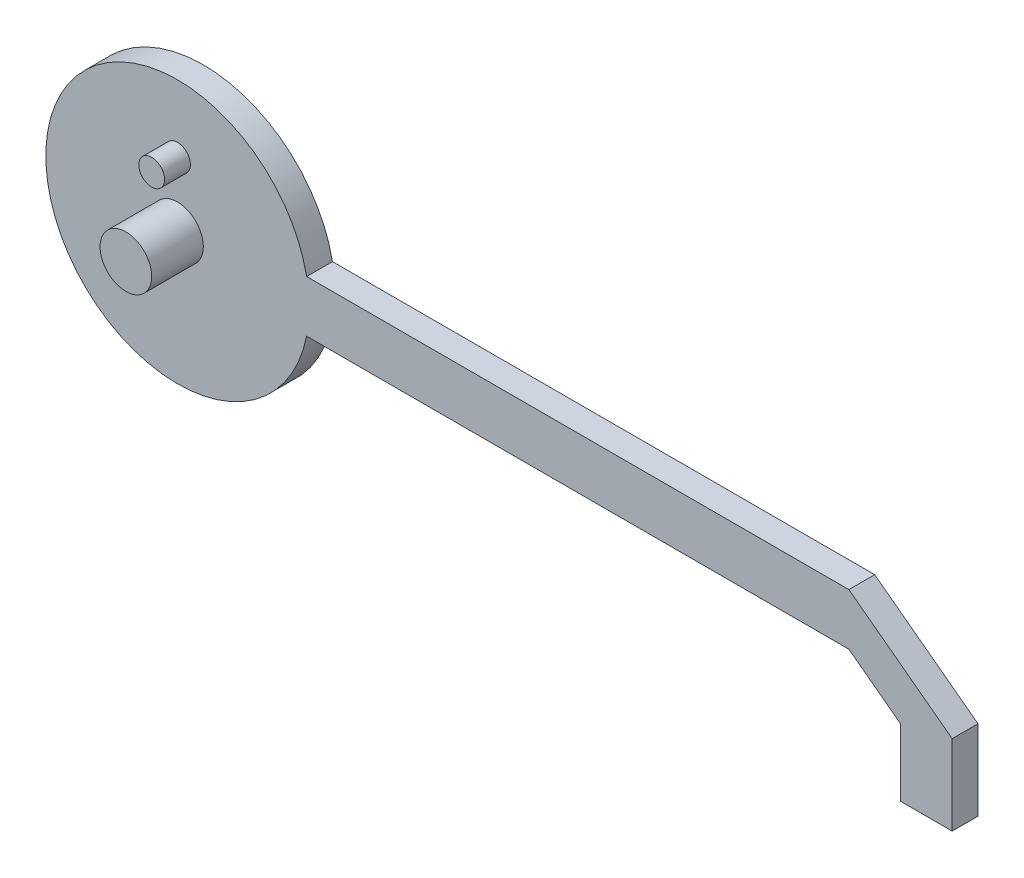
ISO-10303-21;
HEADER;
FILE_DESCRIPTION(('STEP AP214'),'2;1');
FILE_NAME('part.step','',(''),(''),'','','');
FILE_SCHEMA(('AUTOMOTIVE_DESIGN { 1 0 10303 214 1 1 1 1 }'));
ENDSEC;
DATA;
#1=APPLICATION_CONTEXT('core data for automotive mechanical design processes');
#2=APPLICATION_PROTOCOL_DEFINITION('international standard','automotive_design',2000,#1);
#3=PRODUCT_CONTEXT('',#1,'mechanical');
#4=PRODUCT('Part','Part','',(#3));
#5=PRODUCT_RELATED_PRODUCT_CATEGORY('part','',(#4));
#6=PRODUCT_DEFINITION_FORMATION('','',#4);
#7=PRODUCT_DEFINITION_CONTEXT('part definition',#1,'design');
#8=PRODUCT_DEFINITION('design','',#6,#7);
#9=PRODUCT_DEFINITION_SHAPE('','',#8);
#10=(LENGTH_UNIT() NAMED_UNIT(*) SI_UNIT(.MILLI.,.METRE.));
#11=(NAMED_UNIT(*) PLANE_ANGLE_UNIT() SI_UNIT($,.RADIAN.));
#12=(NAMED_UNIT(*) SI_UNIT($,.STERADIAN.) SOLID_ANGLE_UNIT());
#13=UNCERTAINTY_MEASURE_WITH_UNIT(LENGTH_MEASURE(1.E-05),#10,'distance_accuracy_value','');
#14=(GEOMETRIC_REPRESENTATION_CONTEXT(3) GLOBAL_UNCERTAINTY_ASSIGNED_CONTEXT((#13)) GLOBAL_UNIT_ASSIGNED_CONTEXT((#10,
#11,#12)) REPRESENTATION_CONTEXT('',''));
#15=CARTESIAN_POINT('',(0.,0.,0.));
#16=DIRECTION('',(0.,0.,1.));
#17=DIRECTION('',(1.,0.,0.));
#18=AXIS2_PLACEMENT_3D('',#15,#16,#17);
#19=CARTESIAN_POINT('',(-77.5024997500499,0.,5.));
#20=DIRECTION('',(0.,0.,-1.));
#21=DIRECTION('',(-1.,0.,0.));
#22=AXIS2_PLACEMENT_3D('',#19,#20,#21);
#23=CYLINDRICAL_SURFACE('',#22,25.5);
#24=CARTESIAN_POINT('',(-77.5024997500499,0.,0.));
#25=DIRECTION('',(0.,0.,1.));
#26=DIRECTION('',(1.,0.,0.));
#27=AXIS2_PLACEMENT_3D('',#24,#25,#26);
#28=CIRCLE('',#27,25.5);
#29=CARTESIAN_POINT('',(-52.4975002499499,5.,0.));
#30=VERTEX_POINT('',#29);
#31=CARTESIAN_POINT('',(-52.4975002499499,-5.,0.));
#32=VERTEX_POINT('',#31);
#33=EDGE_CURVE('E140',#30,#32,#28,.T.);
#34=ORIENTED_EDGE('',*,*,#33,.T.);
#35=DIRECTION('',(0.,0.,-1.));
#36=VECTOR('',#35,1.);
#37=CARTESIAN_POINT('',(-52.4975002499499,-5.,5.));
#38=LINE('',#37,#36);
#39=CARTESIAN_POINT('',(-52.4975002499499,-5.,5.));
#40=VERTEX_POINT('',#39);
#41=EDGE_CURVE('E11',#40,#32,#38,.T.);
#42=ORIENTED_EDGE('',*,*,#41,.F.);
#43=CARTESIAN_POINT('',(-77.5024997500499,0.,5.));
#44=DIRECTION('',(0.,0.,1.));
#45=DIRECTION('',(1.,0.,0.));
#46=AXIS2_PLACEMENT_3D('',#43,#44,#45);
#47=CIRCLE('',#46,25.5);
#48=CARTESIAN_POINT('',(-52.4975002499499,5.,5.));
#49=VERTEX_POINT('',#48);
#50=EDGE_CURVE('E163',#49,#40,#47,.T.);
#51=ORIENTED_EDGE('',*,*,#50,.F.);
#52=DIRECTION('',(0.,0.,-1.));
#53=VECTOR('',#52,1.);
#54=CARTESIAN_POINT('',(-52.4975002499499,5.,5.));
#55=LINE('',#54,#53);
#56=EDGE_CURVE('E136',#49,#30,#55,.T.);
#57=ORIENTED_EDGE('',*,*,#56,.T.);
#58=EDGE_LOOP('',(#34,#42,#51,#57));
#59=FACE_BOUND('',#58,.T.);
#60=ADVANCED_FACE('F39',(#59),#23,.T.);
#61=CARTESIAN_POINT('',(52.4975002499501,-5.,5.));
#62=DIRECTION('',(0.,1.,0.));
#63=DIRECTION('',(0.,0.,1.));
#64=AXIS2_PLACEMENT_3D('',#61,#62,#63);
#65=PLANE('',#64);
#66=DIRECTION('',(1.,0.,0.));
#67=VECTOR('',#66,1.);
#68=CARTESIAN_POINT('',(52.4975002499501,-5.,0.));
#69=LINE('',#68,#67);
#70=CARTESIAN_POINT('',(52.4975002499501,-5.,0.));
#71=VERTEX_POINT('',#70);
#72=EDGE_CURVE('E144',#32,#71,#69,.T.);
#73=ORIENTED_EDGE('',*,*,#72,.T.);
#74=DIRECTION('',(0.,0.,-1.));
#75=VECTOR('',#74,1.);
#76=CARTESIAN_POINT('',(52.4975002499501,-5.,5.));
#77=LINE('',#76,#75);
#78=CARTESIAN_POINT('',(52.4975002499501,-5.,5.));
#79=VERTEX_POINT('',#78);
#80=EDGE_CURVE('E48',#79,#71,#77,.T.);
#81=ORIENTED_EDGE('',*,*,#80,.F.);
#82=DIRECTION('',(1.,0.,0.));
#83=VECTOR('',#82,1.);
#84=CARTESIAN_POINT('',(52.4975002499501,-5.,5.));
#85=LINE('',#84,#83);
#86=EDGE_CURVE('E99',#40,#79,#85,.T.);
#87=ORIENTED_EDGE('',*,*,#86,.F.);
#88=ORIENTED_EDGE('',*,*,#41,.T.);
#89=EDGE_LOOP('',(#73,#81,#87,#88));
#90=FACE_BOUND('',#89,.T.);
#91=ADVANCED_FACE('F251',(#90),#65,.F.);
#92=CARTESIAN_POINT('',(52.4975002499501,-5.,5.));
#93=DIRECTION('',(0.6,0.8,0.));
#94=DIRECTION('',(-0.8,0.6,0.));
#95=AXIS2_PLACEMENT_3D('',#92,#93,#94);
#96=PLANE('',#95);
#97=DIRECTION('',(0.8,-0.6,0.));
#98=VECTOR('',#97,1.);
#99=CARTESIAN_POINT('',(52.4975002499501,-5.,0.));
#100=LINE('',#99,#98);
#101=CARTESIAN_POINT('',(62.4975002499501,-12.5,0.));
#102=VERTEX_POINT('',#101);
#103=EDGE_CURVE('E148',#71,#102,#100,.T.);
#104=ORIENTED_EDGE('',*,*,#103,.T.);
#105=DIRECTION('',(0.,0.,-1.));
#106=VECTOR('',#105,1.);
#107=CARTESIAN_POINT('',(62.4975002499501,-12.5,5.));
#108=LINE('',#107,#106);
#109=CARTESIAN_POINT('',(62.4975002499501,-12.5,5.));
#110=VERTEX_POINT('',#109);
#111=EDGE_CURVE('E174',#110,#102,#108,.T.);
#112=ORIENTED_EDGE('',*,*,#111,.F.);
#113=DIRECTION('',(0.8,-0.6,0.));
#114=VECTOR('',#113,1.);
#115=CARTESIAN_POINT('',(52.4975002499501,-5.,5.));
#116=LINE('',#115,#114);
#117=EDGE_CURVE('E184',#79,#110,#116,.T.);
#118=ORIENTED_EDGE('',*,*,#117,.F.);
#119=ORIENTED_EDGE('',*,*,#80,.T.);
#120=EDGE_LOOP('',(#104,#112,#118,#119));
#121=FACE_BOUND('',#120,.T.);
#122=ADVANCED_FACE('F182',(#121),#96,.F.);
#123=CARTESIAN_POINT('',(62.4975002499501,-25.5,5.));
#124=DIRECTION('',(1.,0.,0.));
#125=DIRECTION('',(0.,0.,-1.));
#126=AXIS2_PLACEMENT_3D('',#123,#124,#125);
#127=PLANE('',#126);
#128=DIRECTION('',(0.,-1.,0.));
#129=VECTOR('',#128,1.);
#130=CARTESIAN_POINT('',(62.4975002499501,-25.5,0.));
#131=LINE('',#130,#129);
#132=CARTESIAN_POINT('',(62.4975002499501,-25.5,0.));
#133=VERTEX_POINT('',#132);
#134=EDGE_CURVE('E151',#102,#133,#131,.T.);
#135=ORIENTED_EDGE('',*,*,#134,.T.);
#136=DIRECTION('',(0.,0.,-1.));
#137=VECTOR('',#136,1.);
#138=CARTESIAN_POINT('',(62.4975002499501,-25.5,5.));
#139=LINE('',#138,#137);
#140=CARTESIAN_POINT('',(62.4975002499501,-25.5,5.));
#141=VERTEX_POINT('',#140);
#142=EDGE_CURVE('E170',#141,#133,#139,.T.);
#143=ORIENTED_EDGE('',*,*,#142,.F.);
#144=DIRECTION('',(0.,-1.,0.));
#145=VECTOR('',#144,1.);
#146=CARTESIAN_POINT('',(62.4975002499501,-25.5,5.));
#147=LINE('',#146,#145);
#148=EDGE_CURVE('E197',#110,#141,#147,.T.);
#149=ORIENTED_EDGE('',*,*,#148,.F.);
#150=ORIENTED_EDGE('',*,*,#111,.T.);
#151=EDGE_LOOP('',(#135,#143,#149,#150));
#152=FACE_BOUND('',#151,.T.);
#153=ADVANCED_FACE('F192',(#152),#127,.F.);
#154=CARTESIAN_POINT('',(62.4975002499501,-25.5,5.));
#155=DIRECTION('',(0.,1.,0.));
#156=DIRECTION('',(0.,0.,1.));
#157=AXIS2_PLACEMENT_3D('',#154,#155,#156);
#158=PLANE('',#157);
#159=DIRECTION('',(1.,0.,0.));
#160=VECTOR('',#159,1.);
#161=CARTESIAN_POINT('',(62.4975002499501,-25.5,0.));
#162=LINE('',#161,#160);
#163=CARTESIAN_POINT('',(72.4975002499501,-25.5,0.));
#164=VERTEX_POINT('',#163);
#165=EDGE_CURVE('E154',#133,#164,#162,.T.);
#166=ORIENTED_EDGE('',*,*,#165,.T.);
#167=DIRECTION('',(0.,0.,-1.));
#168=VECTOR('',#167,1.);
#169=CARTESIAN_POINT('',(72.4975002499501,-25.5,5.));
#170=LINE('',#169,#168);
#171=CARTESIAN_POINT('',(72.4975002499501,-25.5,5.));
#172=VERTEX_POINT('',#171);
#173=EDGE_CURVE('E129',#172,#164,#170,.T.);
#174=ORIENTED_EDGE('',*,*,#173,.F.);
#175=DIRECTION('',(1.,0.,0.));
#176=VECTOR('',#175,1.);
#177=CARTESIAN_POINT('',(62.4975002499501,-25.5,5.));
#178=LINE('',#177,#176);
#179=EDGE_CURVE('E118',#141,#172,#178,.T.);
#180=ORIENTED_EDGE('',*,*,#179,.F.);
#181=ORIENTED_EDGE('',*,*,#142,.T.);
#182=EDGE_LOOP('',(#166,#174,#180,#181));
#183=FACE_BOUND('',#182,.T.);
#184=ADVANCED_FACE('F195',(#183),#158,.F.);
#185=CARTESIAN_POINT('',(72.4975002499501,-25.5,5.));
#186=DIRECTION('',(-1.,0.,0.));
#187=DIRECTION('',(0.,0.,1.));
#188=AXIS2_PLACEMENT_3D('',#185,#186,#187);
#189=PLANE('',#188);
#190=DIRECTION('',(0.,1.,0.));
#191=VECTOR('',#190,1.);
#192=CARTESIAN_POINT('',(72.4975002499501,-25.5,0.));
#193=LINE('',#192,#191);
#194=CARTESIAN_POINT('',(72.4975002499501,-10.,0.));
#195=VERTEX_POINT('',#194);
#196=EDGE_CURVE('E127',#164,#195,#193,.T.);
#197=ORIENTED_EDGE('',*,*,#196,.T.);
#198=DIRECTION('',(0.,0.,-1.));
#199=VECTOR('',#198,1.);
#200=CARTESIAN_POINT('',(72.4975002499501,-10.,5.));
#201=LINE('',#200,#199);
#202=CARTESIAN_POINT('',(72.4975002499501,-10.,5.));
#203=VERTEX_POINT('',#202);
#204=EDGE_CURVE('E124',#203,#195,#201,.T.);
#205=ORIENTED_EDGE('',*,*,#204,.F.);
#206=DIRECTION('',(0.,1.,0.));
#207=VECTOR('',#206,1.);
#208=CARTESIAN_POINT('',(72.4975002499501,-25.5,5.));
#209=LINE('',#208,#207);
#210=EDGE_CURVE('E112',#172,#203,#209,.T.);
#211=ORIENTED_EDGE('',*,*,#210,.F.);
#212=ORIENTED_EDGE('',*,*,#173,.T.);
#213=EDGE_LOOP('',(#197,#205,#211,#212));
#214=FACE_BOUND('',#213,.T.);
#215=ADVANCED_FACE('F125',(#214),#189,.F.);
#216=CARTESIAN_POINT('',(72.4975002499501,-10.,5.));
#217=DIRECTION('',(-0.6,-0.8,0.));
#218=DIRECTION('',(0.8,-0.6,0.));
#219=AXIS2_PLACEMENT_3D('',#216,#217,#218);
#220=PLANE('',#219);
#221=DIRECTION('',(-0.8,0.6,0.));
#222=VECTOR('',#221,1.);
#223=CARTESIAN_POINT('',(72.4975002499501,-10.,0.));
#224=LINE('',#223,#222);
#225=CARTESIAN_POINT('',(52.4975002499501,5.,0.));
#226=VERTEX_POINT('',#225);
#227=EDGE_CURVE('E85',#195,#226,#224,.T.);
#228=ORIENTED_EDGE('',*,*,#227,.T.);
#229=DIRECTION('',(0.,0.,-1.));
#230=VECTOR('',#229,1.);
#231=CARTESIAN_POINT('',(52.4975002499501,5.,5.));
#232=LINE('',#231,#230);
#233=CARTESIAN_POINT('',(52.4975002499501,5.,5.));
#234=VERTEX_POINT('',#233);
#235=EDGE_CURVE('E130',#234,#226,#232,.T.);
#236=ORIENTED_EDGE('',*,*,#235,.F.);
#237=DIRECTION('',(-0.8,0.6,0.));
#238=VECTOR('',#237,1.);
#239=CARTESIAN_POINT('',(72.4975002499501,-10.,5.));
#240=LINE('',#239,#238);
#241=EDGE_CURVE('E116',#203,#234,#240,.T.);
#242=ORIENTED_EDGE('',*,*,#241,.F.);
#243=ORIENTED_EDGE('',*,*,#204,.T.);
#244=EDGE_LOOP('',(#228,#236,#242,#243));
#245=FACE_BOUND('',#244,.T.);
#246=ADVANCED_FACE('F132',(#245),#220,.F.);
#247=CARTESIAN_POINT('',(-52.4975002499499,5.,5.));
#248=DIRECTION('',(0.,-1.,0.));
#249=DIRECTION('',(0.,0.,-1.));
#250=AXIS2_PLACEMENT_3D('',#247,#248,#249);
#251=PLANE('',#250);
#252=DIRECTION('',(-1.,0.,0.));
#253=VECTOR('',#252,1.);
#254=CARTESIAN_POINT('',(-52.4975002499499,5.,0.));
#255=LINE('',#254,#253);
#256=EDGE_CURVE('E91',#226,#30,#255,.T.);
#257=ORIENTED_EDGE('',*,*,#256,.T.);
#258=ORIENTED_EDGE('',*,*,#56,.F.);
#259=DIRECTION('',(-1.,0.,0.));
#260=VECTOR('',#259,1.);
#261=CARTESIAN_POINT('',(-52.4975002499499,5.,5.));
#262=LINE('',#261,#260);
#263=EDGE_CURVE('E56',#234,#49,#262,.T.);
#264=ORIENTED_EDGE('',*,*,#263,.F.);
#265=ORIENTED_EDGE('',*,*,#235,.T.);
#266=EDGE_LOOP('',(#257,#258,#264,#265));
#267=FACE_BOUND('',#266,.T.);
#268=ADVANCED_FACE('F234',(#267),#251,.F.);
#269=CARTESIAN_POINT('',(-77.5024997500499,0.,5.));
#270=DIRECTION('',(0.,0.,1.));
#271=DIRECTION('',(1.,0.,0.));
#272=AXIS2_PLACEMENT_3D('',#269,#270,#271);
#273=PLANE('',#272);
#274=CARTESIAN_POINT('',(-77.5024997500499,0.,5.));
#275=DIRECTION('',(0.,0.,1.));
#276=DIRECTION('',(1.,0.,0.));
#277=AXIS2_PLACEMENT_3D('',#274,#275,#276);
#278=CIRCLE('',#277,5.);
#279=CARTESIAN_POINT('',(-72.5024997500499,0.,5.));
#280=VERTEX_POINT('',#279);
#281=EDGE_CURVE('E215',#280,#280,#278,.T.);
#282=ORIENTED_EDGE('',*,*,#281,.F.);
#283=EDGE_LOOP('',(#282));
#284=FACE_BOUND('',#283,.T.);
#285=CARTESIAN_POINT('',(-77.5024997500499,12.5,5.));
#286=DIRECTION('',(0.,0.,1.));
#287=DIRECTION('',(1.,0.,0.));
#288=AXIS2_PLACEMENT_3D('',#285,#286,#287);
#289=CIRCLE('',#288,2.50000000000001);
#290=CARTESIAN_POINT('',(-75.0024997500499,12.5,5.));
#291=VERTEX_POINT('',#290);
#292=EDGE_CURVE('E207',#291,#291,#289,.T.);
#293=ORIENTED_EDGE('',*,*,#292,.F.);
#294=EDGE_LOOP('',(#293));
#295=FACE_BOUND('',#294,.T.);
#296=ORIENTED_EDGE('',*,*,#50,.T.);
#297=ORIENTED_EDGE('',*,*,#86,.T.);
#298=ORIENTED_EDGE('',*,*,#117,.T.);
#299=ORIENTED_EDGE('',*,*,#148,.T.);
#300=ORIENTED_EDGE('',*,*,#179,.T.);
#301=ORIENTED_EDGE('',*,*,#210,.T.);
#302=ORIENTED_EDGE('',*,*,#241,.T.);
#303=ORIENTED_EDGE('',*,*,#263,.T.);
#304=EDGE_LOOP('',(#296,#297,#298,#299,#300,#301,#302,#303));
#305=FACE_BOUND('',#304,.T.);
#306=ADVANCED_FACE('F114',(#284,#295,#305),#273,.T.);
#307=CARTESIAN_POINT('',(-77.5024997500499,0.,0.));
#308=DIRECTION('',(0.,0.,1.));
#309=DIRECTION('',(1.,0.,0.));
#310=AXIS2_PLACEMENT_3D('',#307,#308,#309);
#311=PLANE('',#310);
#312=ORIENTED_EDGE('',*,*,#33,.F.);
#313=ORIENTED_EDGE('',*,*,#256,.F.);
#314=ORIENTED_EDGE('',*,*,#227,.F.);
#315=ORIENTED_EDGE('',*,*,#196,.F.);
#316=ORIENTED_EDGE('',*,*,#165,.F.);
#317=ORIENTED_EDGE('',*,*,#134,.F.);
#318=ORIENTED_EDGE('',*,*,#103,.F.);
#319=ORIENTED_EDGE('',*,*,#72,.F.);
#320=EDGE_LOOP('',(#312,#313,#314,#315,#316,#317,#318,#319));
#321=FACE_BOUND('',#320,.T.);
#322=ADVANCED_FACE('F188',(#321),#311,.F.);
#323=CARTESIAN_POINT('',(-77.5024997500499,12.5,10.));
#324=DIRECTION('',(0.,0.,-1.));
#325=DIRECTION('',(-1.,0.,0.));
#326=AXIS2_PLACEMENT_3D('',#323,#324,#325);
#327=CYLINDRICAL_SURFACE('',#326,2.50000000000001);
#328=CARTESIAN_POINT('',(-77.5024997500499,12.5,10.));
#329=DIRECTION('',(0.,0.,1.));
#330=DIRECTION('',(1.,0.,0.));
#331=AXIS2_PLACEMENT_3D('',#328,#329,#330);
#332=CIRCLE('',#331,2.50000000000001);
#333=CARTESIAN_POINT('',(-75.0024997500499,12.5,10.));
#334=VERTEX_POINT('',#333);
#335=EDGE_CURVE('E145',#334,#334,#332,.T.);
#336=ORIENTED_EDGE('',*,*,#335,.F.);
#337=EDGE_LOOP('',(#336));
#338=FACE_BOUND('',#337,.T.);
#339=ORIENTED_EDGE('',*,*,#292,.T.);
#340=EDGE_LOOP('',(#339));
#341=FACE_BOUND('',#340,.T.);
#342=ADVANCED_FACE('F238',(#338,#341),#327,.T.);
#343=CARTESIAN_POINT('',(-77.5024997500499,12.5,10.));
#344=DIRECTION('',(0.,0.,1.));
#345=DIRECTION('',(1.,0.,0.));
#346=AXIS2_PLACEMENT_3D('',#343,#344,#345);
#347=PLANE('',#346);
#348=ORIENTED_EDGE('',*,*,#335,.T.);
#349=EDGE_LOOP('',(#348));
#350=FACE_BOUND('',#349,.T.);
#351=ADVANCED_FACE('F228',(#350),#347,.T.);
#352=CARTESIAN_POINT('',(-77.5024997500499,0.,15.));
#353=DIRECTION('',(0.,0.,-1.));
#354=DIRECTION('',(-1.,0.,0.));
#355=AXIS2_PLACEMENT_3D('',#352,#353,#354);
#356=CYLINDRICAL_SURFACE('',#355,5.);
#357=CARTESIAN_POINT('',(-77.5024997500499,0.,15.));
#358=DIRECTION('',(0.,0.,1.));
#359=DIRECTION('',(1.,0.,0.));
#360=AXIS2_PLACEMENT_3D('',#357,#358,#359);
#361=CIRCLE('',#360,5.);
#362=CARTESIAN_POINT('',(-72.5024997500499,0.,15.));
#363=VERTEX_POINT('',#362);
#364=EDGE_CURVE('E211',#363,#363,#361,.T.);
#365=ORIENTED_EDGE('',*,*,#364,.F.);
#366=EDGE_LOOP('',(#365));
#367=FACE_BOUND('',#366,.T.);
#368=ORIENTED_EDGE('',*,*,#281,.T.);
#369=EDGE_LOOP('',(#368));
#370=FACE_BOUND('',#369,.T.);
#371=ADVANCED_FACE('F225',(#367,#370),#356,.T.);
#372=CARTESIAN_POINT('',(-77.5024997500499,0.,15.));
#373=DIRECTION('',(0.,0.,1.));
#374=DIRECTION('',(1.,0.,0.));
#375=AXIS2_PLACEMENT_3D('',#372,#373,#374);
#376=PLANE('',#375);
#377=ORIENTED_EDGE('',*,*,#364,.T.);
#378=EDGE_LOOP('',(#377));
#379=FACE_BOUND('',#378,.T.);
#380=ADVANCED_FACE('F223',(#379),#376,.T.);
#381=CLOSED_SHELL('',(#60,#91,#122,#153,#184,#215,#246,#268,#306,#322,#342,#351,#371,#380));
#382=MANIFOLD_SOLID_BREP('B2',#381);
#383=ADVANCED_BREP_SHAPE_REPRESENTATION('',(#18,#382),#14);
#384=SHAPE_DEFINITION_REPRESENTATION(#9,#383);
ENDSEC;
END-ISO-10303-21;
